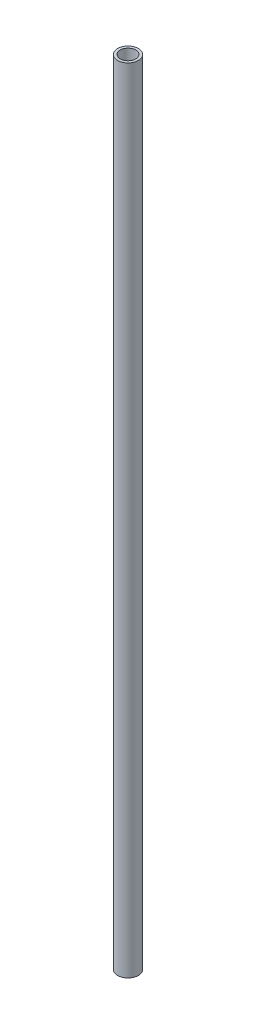
ISO-10303-21;
HEADER;
FILE_DESCRIPTION(('STEP AP214'),'2;1');
FILE_NAME('part.step','',(''),(''),'','','');
FILE_SCHEMA(('AUTOMOTIVE_DESIGN { 1 0 10303 214 1 1 1 1 }'));
ENDSEC;
DATA;
#1=APPLICATION_CONTEXT('core data for automotive mechanical design processes');
#2=APPLICATION_PROTOCOL_DEFINITION('international standard','automotive_design',2000,#1);
#3=PRODUCT_CONTEXT('',#1,'mechanical');
#4=PRODUCT('Part','Part','',(#3));
#5=PRODUCT_RELATED_PRODUCT_CATEGORY('part','',(#4));
#6=PRODUCT_DEFINITION_FORMATION('','',#4);
#7=PRODUCT_DEFINITION_CONTEXT('part definition',#1,'design');
#8=PRODUCT_DEFINITION('design','',#6,#7);
#9=PRODUCT_DEFINITION_SHAPE('','',#8);
#10=(LENGTH_UNIT() NAMED_UNIT(*) SI_UNIT(.MILLI.,.METRE.));
#11=(NAMED_UNIT(*) PLANE_ANGLE_UNIT() SI_UNIT($,.RADIAN.));
#12=(NAMED_UNIT(*) SI_UNIT($,.STERADIAN.) SOLID_ANGLE_UNIT());
#13=UNCERTAINTY_MEASURE_WITH_UNIT(LENGTH_MEASURE(1.E-05),#10,'distance_accuracy_value','');
#14=(GEOMETRIC_REPRESENTATION_CONTEXT(3) GLOBAL_UNCERTAINTY_ASSIGNED_CONTEXT((#13)) GLOBAL_UNIT_ASSIGNED_CONTEXT((#10,
#11,#12)) REPRESENTATION_CONTEXT('',''));
#15=CARTESIAN_POINT('',(0.,0.,0.));
#16=DIRECTION('',(0.,0.,1.));
#17=DIRECTION('',(1.,0.,0.));
#18=AXIS2_PLACEMENT_3D('',#15,#16,#17);
#19=CARTESIAN_POINT('',(0.,76.5,0.));
#20=DIRECTION('',(0.,1.,0.));
#21=DIRECTION('',(0.,0.,1.));
#22=AXIS2_PLACEMENT_3D('',#19,#20,#21);
#23=PLANE('',#22);
#24=CARTESIAN_POINT('',(0.,76.5,0.));
#25=DIRECTION('',(0.,1.,0.));
#26=DIRECTION('',(0.,0.,1.));
#27=AXIS2_PLACEMENT_3D('',#24,#25,#26);
#28=CIRCLE('',#27,2.);
#29=CARTESIAN_POINT('',(0.,76.5,2.));
#30=VERTEX_POINT('',#29);
#31=EDGE_CURVE('E10',#30,#30,#28,.T.);
#32=ORIENTED_EDGE('',*,*,#31,.T.);
#33=EDGE_LOOP('',(#32));
#34=FACE_BOUND('',#33,.T.);
#35=CARTESIAN_POINT('',(0.,76.5,0.));
#36=DIRECTION('',(0.,1.,0.));
#37=DIRECTION('',(0.,0.,1.));
#38=AXIS2_PLACEMENT_3D('',#35,#36,#37);
#39=CIRCLE('',#38,1.5);
#40=CARTESIAN_POINT('',(0.,76.5,1.5));
#41=VERTEX_POINT('',#40);
#42=EDGE_CURVE('E48',#41,#41,#39,.T.);
#43=ORIENTED_EDGE('',*,*,#42,.F.);
#44=EDGE_LOOP('',(#43));
#45=FACE_BOUND('',#44,.T.);
#46=ADVANCED_FACE('F37',(#34,#45),#23,.T.);
#47=CARTESIAN_POINT('',(0.,-76.5,0.));
#48=DIRECTION('',(0.,1.,0.));
#49=DIRECTION('',(0.,0.,1.));
#50=AXIS2_PLACEMENT_3D('',#47,#48,#49);
#51=PLANE('',#50);
#52=CARTESIAN_POINT('',(0.,-76.5,0.));
#53=DIRECTION('',(0.,1.,0.));
#54=DIRECTION('',(0.,0.,1.));
#55=AXIS2_PLACEMENT_3D('',#52,#53,#54);
#56=CIRCLE('',#55,2.);
#57=CARTESIAN_POINT('',(0.,-76.5,2.));
#58=VERTEX_POINT('',#57);
#59=EDGE_CURVE('E41',#58,#58,#56,.T.);
#60=ORIENTED_EDGE('',*,*,#59,.F.);
#61=EDGE_LOOP('',(#60));
#62=FACE_BOUND('',#61,.T.);
#63=CARTESIAN_POINT('',(0.,-76.5,0.));
#64=DIRECTION('',(0.,1.,0.));
#65=DIRECTION('',(0.,0.,1.));
#66=AXIS2_PLACEMENT_3D('',#63,#64,#65);
#67=CIRCLE('',#66,1.5);
#68=CARTESIAN_POINT('',(0.,-76.5,1.5));
#69=VERTEX_POINT('',#68);
#70=EDGE_CURVE('E50',#69,#69,#67,.T.);
#71=ORIENTED_EDGE('',*,*,#70,.T.);
#72=EDGE_LOOP('',(#71));
#73=FACE_BOUND('',#72,.T.);
#74=ADVANCED_FACE('F60',(#62,#73),#51,.F.);
#75=CARTESIAN_POINT('',(0.,76.5,0.));
#76=DIRECTION('',(0.,-1.,0.));
#77=DIRECTION('',(0.,0.,-1.));
#78=AXIS2_PLACEMENT_3D('',#75,#76,#77);
#79=CYLINDRICAL_SURFACE('',#78,2.);
#80=ORIENTED_EDGE('',*,*,#31,.F.);
#81=EDGE_LOOP('',(#80));
#82=FACE_BOUND('',#81,.T.);
#83=ORIENTED_EDGE('',*,*,#59,.T.);
#84=EDGE_LOOP('',(#83));
#85=FACE_BOUND('',#84,.T.);
#86=ADVANCED_FACE('F39',(#82,#85),#79,.T.);
#87=CARTESIAN_POINT('',(0.,76.5,0.));
#88=DIRECTION('',(0.,-1.,0.));
#89=DIRECTION('',(0.,0.,-1.));
#90=AXIS2_PLACEMENT_3D('',#87,#88,#89);
#91=CYLINDRICAL_SURFACE('',#90,1.5);
#92=ORIENTED_EDGE('',*,*,#42,.T.);
#93=EDGE_LOOP('',(#92));
#94=FACE_BOUND('',#93,.T.);
#95=ORIENTED_EDGE('',*,*,#70,.F.);
#96=EDGE_LOOP('',(#95));
#97=FACE_BOUND('',#96,.T.);
#98=ADVANCED_FACE('F56',(#94,#97),#91,.F.);
#99=CLOSED_SHELL('',(#46,#74,#86,#98));
#100=MANIFOLD_SOLID_BREP('B2',#99);
#101=ADVANCED_BREP_SHAPE_REPRESENTATION('',(#18,#100),#14);
#102=SHAPE_DEFINITION_REPRESENTATION(#9,#101);
ENDSEC;
END-ISO-10303-21;
